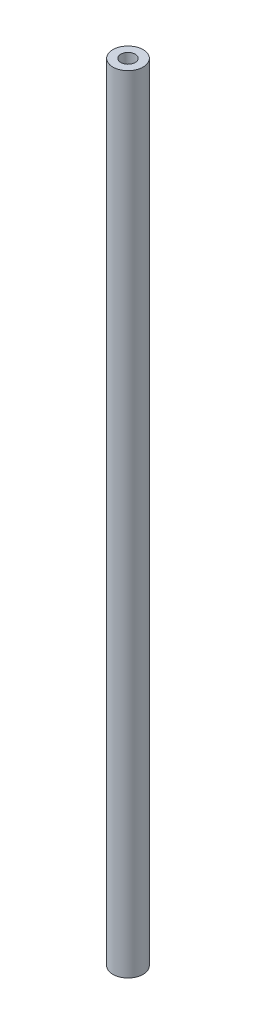
ISO-10303-21;
HEADER;
FILE_DESCRIPTION(('STEP AP214'),'2;1');
FILE_NAME('part.step','',(''),(''),'','','');
FILE_SCHEMA(('AUTOMOTIVE_DESIGN { 1 0 10303 214 1 1 1 1 }'));
ENDSEC;
DATA;
#1=APPLICATION_CONTEXT('core data for automotive mechanical design processes');
#2=APPLICATION_PROTOCOL_DEFINITION('international standard','automotive_design',2000,#1);
#3=PRODUCT_CONTEXT('',#1,'mechanical');
#4=PRODUCT('Part','Part','',(#3));
#5=PRODUCT_RELATED_PRODUCT_CATEGORY('part','',(#4));
#6=PRODUCT_DEFINITION_FORMATION('','',#4);
#7=PRODUCT_DEFINITION_CONTEXT('part definition',#1,'design');
#8=PRODUCT_DEFINITION('design','',#6,#7);
#9=PRODUCT_DEFINITION_SHAPE('','',#8);
#10=(LENGTH_UNIT() NAMED_UNIT(*) SI_UNIT(.MILLI.,.METRE.));
#11=(NAMED_UNIT(*) PLANE_ANGLE_UNIT() SI_UNIT($,.RADIAN.));
#12=(NAMED_UNIT(*) SI_UNIT($,.STERADIAN.) SOLID_ANGLE_UNIT());
#13=UNCERTAINTY_MEASURE_WITH_UNIT(LENGTH_MEASURE(1.E-05),#10,'distance_accuracy_value','');
#14=(GEOMETRIC_REPRESENTATION_CONTEXT(3) GLOBAL_UNCERTAINTY_ASSIGNED_CONTEXT((#13)) GLOBAL_UNIT_ASSIGNED_CONTEXT((#10,
#11,#12)) REPRESENTATION_CONTEXT('',''));
#15=CARTESIAN_POINT('',(0.,0.,0.));
#16=DIRECTION('',(0.,0.,1.));
#17=DIRECTION('',(1.,0.,0.));
#18=AXIS2_PLACEMENT_3D('',#15,#16,#17);
#19=CARTESIAN_POINT('',(0.,165.1,0.));
#20=DIRECTION('',(0.,1.,0.));
#21=DIRECTION('',(0.,0.,1.));
#22=AXIS2_PLACEMENT_3D('',#19,#20,#21);
#23=PLANE('',#22);
#24=CARTESIAN_POINT('',(0.,165.1,0.));
#25=DIRECTION('',(0.,1.,0.));
#26=DIRECTION('',(0.,0.,1.));
#27=AXIS2_PLACEMENT_3D('',#24,#25,#26);
#28=CIRCLE('',#27,3.175);
#29=CARTESIAN_POINT('',(0.,165.1,3.175));
#30=VERTEX_POINT('',#29);
#31=EDGE_CURVE('E10',#30,#30,#28,.T.);
#32=ORIENTED_EDGE('',*,*,#31,.T.);
#33=EDGE_LOOP('',(#32));
#34=FACE_BOUND('',#33,.T.);
#35=CARTESIAN_POINT('',(0.,165.1,0.));
#36=DIRECTION('',(0.,1.,0.));
#37=DIRECTION('',(0.,0.,1.));
#38=AXIS2_PLACEMENT_3D('',#35,#36,#37);
#39=CIRCLE('',#38,1.524);
#40=CARTESIAN_POINT('',(0.,165.1,1.524));
#41=VERTEX_POINT('',#40);
#42=EDGE_CURVE('E41',#41,#41,#39,.T.);
#43=ORIENTED_EDGE('',*,*,#42,.F.);
#44=EDGE_LOOP('',(#43));
#45=FACE_BOUND('',#44,.T.);
#46=ADVANCED_FACE('F30',(#34,#45),#23,.T.);
#47=CARTESIAN_POINT('',(0.,0.,0.));
#48=DIRECTION('',(0.,1.,0.));
#49=DIRECTION('',(0.,0.,1.));
#50=AXIS2_PLACEMENT_3D('',#47,#48,#49);
#51=PLANE('',#50);
#52=CARTESIAN_POINT('',(0.,0.,0.));
#53=DIRECTION('',(0.,1.,0.));
#54=DIRECTION('',(0.,0.,1.));
#55=AXIS2_PLACEMENT_3D('',#52,#53,#54);
#56=CIRCLE('',#55,3.175);
#57=CARTESIAN_POINT('',(0.,0.,3.175));
#58=VERTEX_POINT('',#57);
#59=EDGE_CURVE('E34',#58,#58,#56,.T.);
#60=ORIENTED_EDGE('',*,*,#59,.F.);
#61=EDGE_LOOP('',(#60));
#62=FACE_BOUND('',#61,.T.);
#63=CARTESIAN_POINT('',(0.,0.,0.));
#64=DIRECTION('',(0.,1.,0.));
#65=DIRECTION('',(0.,0.,1.));
#66=AXIS2_PLACEMENT_3D('',#63,#64,#65);
#67=CIRCLE('',#66,1.524);
#68=CARTESIAN_POINT('',(0.,0.,1.524));
#69=VERTEX_POINT('',#68);
#70=EDGE_CURVE('E43',#69,#69,#67,.T.);
#71=ORIENTED_EDGE('',*,*,#70,.T.);
#72=EDGE_LOOP('',(#71));
#73=FACE_BOUND('',#72,.T.);
#74=ADVANCED_FACE('F53',(#62,#73),#51,.F.);
#75=CARTESIAN_POINT('',(0.,165.1,0.));
#76=DIRECTION('',(0.,-1.,0.));
#77=DIRECTION('',(0.,0.,-1.));
#78=AXIS2_PLACEMENT_3D('',#75,#76,#77);
#79=CYLINDRICAL_SURFACE('',#78,3.175);
#80=ORIENTED_EDGE('',*,*,#31,.F.);
#81=EDGE_LOOP('',(#80));
#82=FACE_BOUND('',#81,.T.);
#83=ORIENTED_EDGE('',*,*,#59,.T.);
#84=EDGE_LOOP('',(#83));
#85=FACE_BOUND('',#84,.T.);
#86=ADVANCED_FACE('F32',(#82,#85),#79,.T.);
#87=CARTESIAN_POINT('',(0.,165.1,0.));
#88=DIRECTION('',(0.,-1.,0.));
#89=DIRECTION('',(0.,0.,-1.));
#90=AXIS2_PLACEMENT_3D('',#87,#88,#89);
#91=CYLINDRICAL_SURFACE('',#90,1.524);
#92=ORIENTED_EDGE('',*,*,#42,.T.);
#93=EDGE_LOOP('',(#92));
#94=FACE_BOUND('',#93,.T.);
#95=ORIENTED_EDGE('',*,*,#70,.F.);
#96=EDGE_LOOP('',(#95));
#97=FACE_BOUND('',#96,.T.);
#98=ADVANCED_FACE('F49',(#94,#97),#91,.F.);
#99=CLOSED_SHELL('',(#46,#74,#86,#98));
#100=MANIFOLD_SOLID_BREP('B2',#99);
#101=ADVANCED_BREP_SHAPE_REPRESENTATION('',(#18,#100),#14);
#102=SHAPE_DEFINITION_REPRESENTATION(#9,#101);
ENDSEC;
END-ISO-10303-21;
